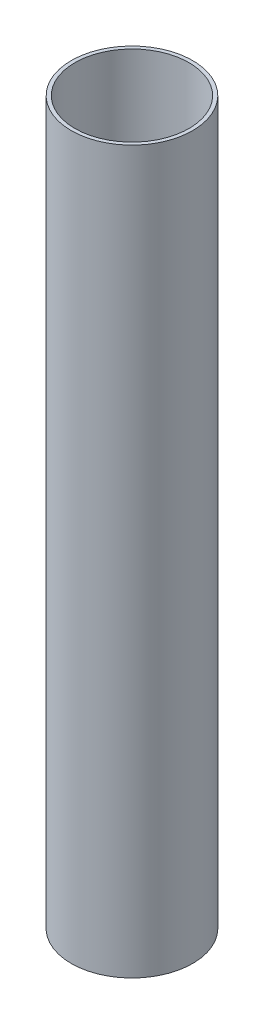
ISO-10303-21;
HEADER;
FILE_DESCRIPTION(('STEP AP214'),'2;1');
FILE_NAME('part.step','',(''),(''),'','','');
FILE_SCHEMA(('AUTOMOTIVE_DESIGN { 1 0 10303 214 1 1 1 1 }'));
ENDSEC;
DATA;
#1=APPLICATION_CONTEXT('core data for automotive mechanical design processes');
#2=APPLICATION_PROTOCOL_DEFINITION('international standard','automotive_design',2000,#1);
#3=PRODUCT_CONTEXT('',#1,'mechanical');
#4=PRODUCT('Part','Part','',(#3));
#5=PRODUCT_RELATED_PRODUCT_CATEGORY('part','',(#4));
#6=PRODUCT_DEFINITION_FORMATION('','',#4);
#7=PRODUCT_DEFINITION_CONTEXT('part definition',#1,'design');
#8=PRODUCT_DEFINITION('design','',#6,#7);
#9=PRODUCT_DEFINITION_SHAPE('','',#8);
#10=(LENGTH_UNIT() NAMED_UNIT(*) SI_UNIT(.MILLI.,.METRE.));
#11=(NAMED_UNIT(*) PLANE_ANGLE_UNIT() SI_UNIT($,.RADIAN.));
#12=(NAMED_UNIT(*) SI_UNIT($,.STERADIAN.) SOLID_ANGLE_UNIT());
#13=UNCERTAINTY_MEASURE_WITH_UNIT(LENGTH_MEASURE(1.E-05),#10,'distance_accuracy_value','');
#14=(GEOMETRIC_REPRESENTATION_CONTEXT(3) GLOBAL_UNCERTAINTY_ASSIGNED_CONTEXT((#13)) GLOBAL_UNIT_ASSIGNED_CONTEXT((#10,
#11,#12)) REPRESENTATION_CONTEXT('',''));
#15=CARTESIAN_POINT('',(0.,0.,0.));
#16=DIRECTION('',(0.,0.,1.));
#17=DIRECTION('',(1.,0.,0.));
#18=AXIS2_PLACEMENT_3D('',#15,#16,#17);
#19=CARTESIAN_POINT('',(0.,297.,0.));
#20=DIRECTION('',(0.,1.,0.));
#21=DIRECTION('',(0.,0.,1.));
#22=AXIS2_PLACEMENT_3D('',#19,#20,#21);
#23=PLANE('',#22);
#24=CARTESIAN_POINT('',(0.,297.,0.));
#25=DIRECTION('',(0.,1.,0.));
#26=DIRECTION('',(0.,0.,1.));
#27=AXIS2_PLACEMENT_3D('',#24,#25,#26);
#28=CIRCLE('',#27,25.);
#29=CARTESIAN_POINT('',(0.,297.,25.));
#30=VERTEX_POINT('',#29);
#31=EDGE_CURVE('E10',#30,#30,#28,.T.);
#32=ORIENTED_EDGE('',*,*,#31,.T.);
#33=EDGE_LOOP('',(#32));
#34=FACE_BOUND('',#33,.T.);
#35=CARTESIAN_POINT('',(0.,297.,0.));
#36=DIRECTION('',(0.,1.,0.));
#37=DIRECTION('',(0.,0.,1.));
#38=AXIS2_PLACEMENT_3D('',#35,#36,#37);
#39=CIRCLE('',#38,23.5);
#40=CARTESIAN_POINT('',(0.,297.,23.5));
#41=VERTEX_POINT('',#40);
#42=EDGE_CURVE('E51',#41,#41,#39,.T.);
#43=ORIENTED_EDGE('',*,*,#42,.F.);
#44=EDGE_LOOP('',(#43));
#45=FACE_BOUND('',#44,.T.);
#46=ADVANCED_FACE('F40',(#34,#45),#23,.T.);
#47=CARTESIAN_POINT('',(0.,0.,0.));
#48=DIRECTION('',(0.,1.,0.));
#49=DIRECTION('',(0.,0.,1.));
#50=AXIS2_PLACEMENT_3D('',#47,#48,#49);
#51=PLANE('',#50);
#52=CARTESIAN_POINT('',(0.,0.,0.));
#53=DIRECTION('',(0.,1.,0.));
#54=DIRECTION('',(0.,0.,1.));
#55=AXIS2_PLACEMENT_3D('',#52,#53,#54);
#56=CIRCLE('',#55,25.);
#57=CARTESIAN_POINT('',(0.,0.,25.));
#58=VERTEX_POINT('',#57);
#59=EDGE_CURVE('E44',#58,#58,#56,.T.);
#60=ORIENTED_EDGE('',*,*,#59,.F.);
#61=EDGE_LOOP('',(#60));
#62=FACE_BOUND('',#61,.T.);
#63=CARTESIAN_POINT('',(0.,0.,0.));
#64=DIRECTION('',(0.,1.,0.));
#65=DIRECTION('',(0.,0.,1.));
#66=AXIS2_PLACEMENT_3D('',#63,#64,#65);
#67=CIRCLE('',#66,23.5);
#68=CARTESIAN_POINT('',(0.,0.,23.5));
#69=VERTEX_POINT('',#68);
#70=EDGE_CURVE('E53',#69,#69,#67,.T.);
#71=ORIENTED_EDGE('',*,*,#70,.T.);
#72=EDGE_LOOP('',(#71));
#73=FACE_BOUND('',#72,.T.);
#74=ADVANCED_FACE('F63',(#62,#73),#51,.F.);
#75=CARTESIAN_POINT('',(0.,297.,0.));
#76=DIRECTION('',(0.,-1.,0.));
#77=DIRECTION('',(0.,0.,-1.));
#78=AXIS2_PLACEMENT_3D('',#75,#76,#77);
#79=CYLINDRICAL_SURFACE('',#78,25.);
#80=ORIENTED_EDGE('',*,*,#31,.F.);
#81=EDGE_LOOP('',(#80));
#82=FACE_BOUND('',#81,.T.);
#83=ORIENTED_EDGE('',*,*,#59,.T.);
#84=EDGE_LOOP('',(#83));
#85=FACE_BOUND('',#84,.T.);
#86=ADVANCED_FACE('F42',(#82,#85),#79,.T.);
#87=CARTESIAN_POINT('',(0.,297.,0.));
#88=DIRECTION('',(0.,-1.,0.));
#89=DIRECTION('',(0.,0.,-1.));
#90=AXIS2_PLACEMENT_3D('',#87,#88,#89);
#91=CYLINDRICAL_SURFACE('',#90,23.5);
#92=ORIENTED_EDGE('',*,*,#42,.T.);
#93=EDGE_LOOP('',(#92));
#94=FACE_BOUND('',#93,.T.);
#95=ORIENTED_EDGE('',*,*,#70,.F.);
#96=EDGE_LOOP('',(#95));
#97=FACE_BOUND('',#96,.T.);
#98=ADVANCED_FACE('F59',(#94,#97),#91,.F.);
#99=CLOSED_SHELL('',(#46,#74,#86,#98));
#100=MANIFOLD_SOLID_BREP('B2',#99);
#101=ADVANCED_BREP_SHAPE_REPRESENTATION('',(#18,#100),#14);
#102=SHAPE_DEFINITION_REPRESENTATION(#9,#101);
ENDSEC;
END-ISO-10303-21;
